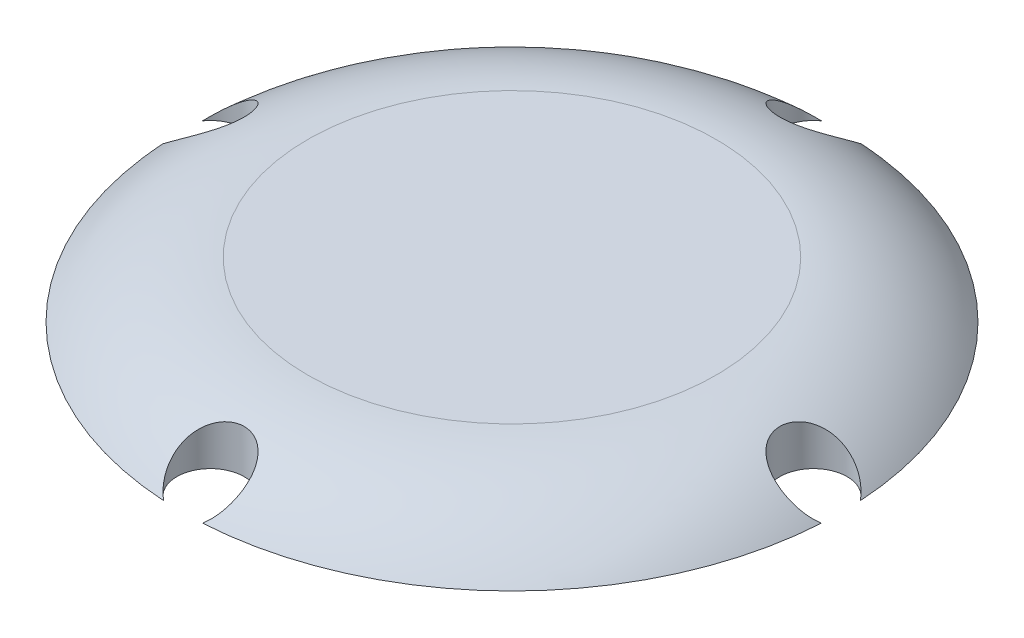
ISO-10303-21;
HEADER;
FILE_DESCRIPTION(('STEP AP214'),'2;1');
FILE_NAME('part.step','',(''),(''),'','','');
FILE_SCHEMA(('AUTOMOTIVE_DESIGN { 1 0 10303 214 1 1 1 1 }'));
ENDSEC;
DATA;
#1=APPLICATION_CONTEXT('core data for automotive mechanical design processes');
#2=APPLICATION_PROTOCOL_DEFINITION('international standard','automotive_design',2000,#1);
#3=PRODUCT_CONTEXT('',#1,'mechanical');
#4=PRODUCT('Part','Part','',(#3));
#5=PRODUCT_RELATED_PRODUCT_CATEGORY('part','',(#4));
#6=PRODUCT_DEFINITION_FORMATION('','',#4);
#7=PRODUCT_DEFINITION_CONTEXT('part definition',#1,'design');
#8=PRODUCT_DEFINITION('design','',#6,#7);
#9=PRODUCT_DEFINITION_SHAPE('','',#8);
#10=(LENGTH_UNIT() NAMED_UNIT(*) SI_UNIT(.MILLI.,.METRE.));
#11=(NAMED_UNIT(*) PLANE_ANGLE_UNIT() SI_UNIT($,.RADIAN.));
#12=(NAMED_UNIT(*) SI_UNIT($,.STERADIAN.) SOLID_ANGLE_UNIT());
#13=UNCERTAINTY_MEASURE_WITH_UNIT(LENGTH_MEASURE(1.E-05),#10,'distance_accuracy_value','');
#14=(GEOMETRIC_REPRESENTATION_CONTEXT(3) GLOBAL_UNCERTAINTY_ASSIGNED_CONTEXT((#13)) GLOBAL_UNIT_ASSIGNED_CONTEXT((#10,
#11,#12)) REPRESENTATION_CONTEXT('',''));
#15=CARTESIAN_POINT('',(0.,0.,0.));
#16=DIRECTION('',(0.,0.,1.));
#17=DIRECTION('',(1.,0.,0.));
#18=AXIS2_PLACEMENT_3D('',#15,#16,#17);
#19=CARTESIAN_POINT('',(0.,10.,0.));
#20=DIRECTION('',(0.,1.,0.));
#21=DIRECTION('',(0.,0.,1.));
#22=AXIS2_PLACEMENT_3D('',#19,#20,#21);
#23=PLANE('',#22);
#24=CARTESIAN_POINT('',(0.,10.,0.));
#25=DIRECTION('',(0.,1.,0.));
#26=DIRECTION('',(0.,0.,1.));
#27=AXIS2_PLACEMENT_3D('',#24,#25,#26);
#28=CIRCLE('',#27,36.4393202250021);
#29=CARTESIAN_POINT('',(0.,10.,36.4393202250021));
#30=VERTEX_POINT('',#29);
#31=EDGE_CURVE('E98',#30,#30,#28,.T.);
#32=ORIENTED_EDGE('',*,*,#31,.T.);
#33=EDGE_LOOP('',(#32));
#34=FACE_BOUND('',#33,.T.);
#35=ADVANCED_FACE('F46',(#34),#23,.T.);
#36=CARTESIAN_POINT('',(0.,0.,0.));
#37=DIRECTION('',(0.,1.,0.));
#38=DIRECTION('',(0.,0.,1.));
#39=AXIS2_PLACEMENT_3D('',#36,#37,#38);
#40=PLANE('',#39);
#41=CARTESIAN_POINT('',(0.,0.,0.));
#42=DIRECTION('',(0.,-1.,0.));
#43=DIRECTION('',(0.,0.,-1.));
#44=AXIS2_PLACEMENT_3D('',#41,#42,#43);
#45=CIRCLE('',#44,34.6146270857202);
#46=CARTESIAN_POINT('',(0.,0.,-34.6146270857202));
#47=VERTEX_POINT('',#46);
#48=EDGE_CURVE('E123',#47,#47,#45,.T.);
#49=ORIENTED_EDGE('',*,*,#48,.F.);
#50=EDGE_LOOP('',(#49));
#51=FACE_BOUND('',#50,.T.);
#52=CARTESIAN_POINT('',(0.,0.,0.));
#53=DIRECTION('',(0.,1.,0.));
#54=DIRECTION('',(0.,0.,1.));
#55=AXIS2_PLACEMENT_3D('',#52,#53,#54);
#56=CIRCLE('',#55,58.8);
#57=CARTESIAN_POINT('',(3.46581213584982,0.,58.6977695167286));
#58=VERTEX_POINT('',#57);
#59=CARTESIAN_POINT('',(58.6977695167286,0.,3.46581213584961));
#60=VERTEX_POINT('',#59);
#61=EDGE_CURVE('E117',#58,#60,#56,.T.);
#62=ORIENTED_EDGE('',*,*,#61,.F.);
#63=CARTESIAN_POINT('',(0.,0.,53.8));
#64=DIRECTION('',(0.,-1.,0.));
#65=DIRECTION('',(0.,0.,-1.));
#66=AXIS2_PLACEMENT_3D('',#63,#64,#65);
#67=CIRCLE('',#66,6.);
#68=CARTESIAN_POINT('',(-3.46581213584982,0.,58.6977695167286));
#69=VERTEX_POINT('',#68);
#70=EDGE_CURVE('E163',#69,#58,#67,.T.);
#71=ORIENTED_EDGE('',*,*,#70,.F.);
#72=CARTESIAN_POINT('',(-58.6977695167286,0.,3.46581213585043));
#73=VERTEX_POINT('',#72);
#74=EDGE_CURVE('E106',#73,#69,#56,.T.);
#75=ORIENTED_EDGE('',*,*,#74,.F.);
#76=CARTESIAN_POINT('',(-53.8,0.,5.63525088089282E-13));
#77=DIRECTION('',(0.,-1.,0.));
#78=DIRECTION('',(0.,0.,-1.));
#79=AXIS2_PLACEMENT_3D('',#76,#77,#78);
#80=CIRCLE('',#79,6.);
#81=CARTESIAN_POINT('',(-58.6977695167287,0.,-3.4658121358492));
#82=VERTEX_POINT('',#81);
#83=EDGE_CURVE('E67',#82,#73,#80,.T.);
#84=ORIENTED_EDGE('',*,*,#83,.F.);
#85=CARTESIAN_POINT('',(-3.46581213585023,0.,-58.6977695167286));
#86=VERTEX_POINT('',#85);
#87=EDGE_CURVE('E104',#86,#82,#56,.T.);
#88=ORIENTED_EDGE('',*,*,#87,.F.);
#89=CARTESIAN_POINT('',(-3.75683392059521E-13,0.,-53.8));
#90=DIRECTION('',(0.,-1.,0.));
#91=DIRECTION('',(0.,0.,-1.));
#92=AXIS2_PLACEMENT_3D('',#89,#90,#91);
#93=CIRCLE('',#92,6.);
#94=CARTESIAN_POINT('',(3.46581213584941,0.,-58.6977695167286));
#95=VERTEX_POINT('',#94);
#96=EDGE_CURVE('E74',#95,#86,#93,.T.);
#97=ORIENTED_EDGE('',*,*,#96,.F.);
#98=CARTESIAN_POINT('',(58.6977695167286,0.,-3.46581213585002));
#99=VERTEX_POINT('',#98);
#100=EDGE_CURVE('E113',#99,#95,#56,.T.);
#101=ORIENTED_EDGE('',*,*,#100,.F.);
#102=CARTESIAN_POINT('',(53.8,0.,-1.87841696029761E-13));
#103=DIRECTION('',(0.,-1.,0.));
#104=DIRECTION('',(0.,0.,-1.));
#105=AXIS2_PLACEMENT_3D('',#102,#103,#104);
#106=CIRCLE('',#105,6.);
#107=EDGE_CURVE('E167',#60,#99,#106,.T.);
#108=ORIENTED_EDGE('',*,*,#107,.F.);
#109=EDGE_LOOP('',(#62,#71,#75,#84,#88,#97,#101,#108));
#110=FACE_BOUND('',#109,.T.);
#111=ADVANCED_FACE('F103',(#51,#110),#40,.F.);
#112=CARTESIAN_POINT('',(0.,-20.,0.));
#113=DIRECTION('',(0.,-1.,0.));
#114=DIRECTION('',(0.,0.,-1.));
#115=AXIS2_PLACEMENT_3D('',#112,#113,#114);
#116=TOROIDAL_SURFACE('',#115,36.4393202250021,30.);
#117=CARTESIAN_POINT('',(3.46553583253374,-0.0002,58.6979650257454));
#118=CARTESIAN_POINT('',(3.5558869809211,0.0652055483690038,58.6340304452409));
#119=CARTESIAN_POINT('',(3.64371053577714,0.132121107910499,58.5681468079905));
#120=CARTESIAN_POINT('',(3.81435968798358,0.26854578930122,58.4327674310678));
#121=CARTESIAN_POINT('',(3.89718692167157,0.3380540498162,58.3632728880302));
#122=CARTESIAN_POINT('',(4.1380835569917,0.549663816380266,58.1499693700189));
#123=CARTESIAN_POINT('',(4.28886287916948,0.695066932544035,58.0011296032495));
#124=CARTESIAN_POINT('',(4.57063315979327,0.991189557479545,57.6926538642796));
#125=CARTESIAN_POINT('',(4.70171380280407,1.14188086362398,57.533071928734));
#126=CARTESIAN_POINT('',(4.94533166596503,1.44725837767899,57.2037700731015));
#127=CARTESIAN_POINT('',(5.0578618462832,1.60194607656434,57.0340463373774));
#128=CARTESIAN_POINT('',(5.25544558650792,1.90006618495907,56.7007723935405));
#129=CARTESIAN_POINT('',(5.3420356437114,2.04331136175965,56.5379631772336));
#130=CARTESIAN_POINT('',(5.49969293577057,2.33062017522033,56.2056660305868));
#131=CARTESIAN_POINT('',(5.57075480089029,2.47468407738663,56.0361758137598));
#132=CARTESIAN_POINT('',(5.76052216977926,2.90721718976167,55.5180701708327));
#133=CARTESIAN_POINT('',(5.85555880071061,3.19564627212132,55.1602441777271));
#134=CARTESIAN_POINT('',(5.95276204092302,3.64483381142573,54.5816818379375));
#135=CARTESIAN_POINT('',(5.97716913902422,3.80833907023288,54.3664825972896));
#136=CARTESIAN_POINT('',(6.00250482381479,4.13150036849085,53.9316661935034));
#137=CARTESIAN_POINT('',(6.0034294617481,4.29115575604677,53.7120482935476));
#138=CARTESIAN_POINT('',(5.98068293816353,4.60490334590427,53.2706591749769));
#139=CARTESIAN_POINT('',(5.95705195323374,4.75900421002941,53.0488920600315));
#140=CARTESIAN_POINT('',(5.88409837667664,5.06049135401063,52.6050455312248));
#141=CARTESIAN_POINT('',(5.83478590316606,5.2078802534279,52.3829662746832));
#142=CARTESIAN_POINT('',(5.72625873629117,5.45597169570146,52.0005070675757));
#143=CARTESIAN_POINT('',(5.67326262915145,5.55857964970645,51.8395786316137));
#144=CARTESIAN_POINT('',(5.55261204567847,5.75884253819105,51.5201692778292));
#145=CARTESIAN_POINT('',(5.48496090077979,5.85649859213784,51.3616878125097));
#146=CARTESIAN_POINT('',(5.33473729531485,6.04628241042703,51.0485018874182));
#147=CARTESIAN_POINT('',(5.25216422904856,6.13840995015762,50.8937975812554));
#148=CARTESIAN_POINT('',(5.0720350733488,6.31650283343753,50.5897566553267));
#149=CARTESIAN_POINT('',(4.97448643423619,6.40247121013745,50.4404174117925));
#150=CARTESIAN_POINT('',(4.76364937393307,6.56836880687971,50.1475420252663));
#151=CARTESIAN_POINT('',(4.65024498272296,6.64824613989962,50.0040597379913));
#152=CARTESIAN_POINT('',(4.40867169719676,6.80063919894988,49.7259956243438));
#153=CARTESIAN_POINT('',(4.28051002791773,6.87315849497153,49.591409492866));
#154=CARTESIAN_POINT('',(4.01003106731339,7.01038088917507,49.3329390416587));
#155=CARTESIAN_POINT('',(3.86771681580253,7.07508565924533,49.2090524344278));
#156=CARTESIAN_POINT('',(3.56985398224137,7.19627935034101,48.9738067771556));
#157=CARTESIAN_POINT('',(3.41430748688584,7.2527695629907,48.8624457582656));
#158=CARTESIAN_POINT('',(3.11155709244978,7.35064392271163,48.6671187080399));
#159=CARTESIAN_POINT('',(2.96576157091769,7.39303430948953,48.5814686724121));
#160=CARTESIAN_POINT('',(2.66604939034357,7.47112407566942,48.4221779313096));
#161=CARTESIAN_POINT('',(2.51213367500718,7.50682423040541,48.3485358343582));
#162=CARTESIAN_POINT('',(2.19743279677077,7.57140136555867,48.2142551139282));
#163=CARTESIAN_POINT('',(2.03665062092316,7.60028127792935,48.1536109038293));
#164=CARTESIAN_POINT('',(1.70948587321766,7.65115598103324,48.0461057063587));
#165=CARTESIAN_POINT('',(1.54310364414782,7.673151192344,47.9992438770496));
#166=CARTESIAN_POINT('',(1.22120062941942,7.7085561798832,47.9234765590647));
#167=CARTESIAN_POINT('',(1.06603219314069,7.72255611051626,47.8933435829854));
#168=CARTESIAN_POINT('',(0.753399546864709,7.74478148236828,47.8453888564223));
#169=CARTESIAN_POINT('',(0.59593547189509,7.75300726183058,47.8275663848039));
#170=CARTESIAN_POINT('',(0.279933096603168,7.76367284496199,47.8044407069692));
#171=CARTESIAN_POINT('',(0.121395051034823,7.7661139757039,47.7991346293325));
#172=CARTESIAN_POINT('',(-0.19558772465995,7.76521132082239,47.8010947292263));
#173=CARTESIAN_POINT('',(-0.354032455237427,7.76186756339428,47.8083608454804));
#174=CARTESIAN_POINT('',(-0.66468761482286,7.74959439102201,47.834957601499));
#175=CARTESIAN_POINT('',(-0.816938148588741,7.74084277112035,47.8539041769245));
#176=CARTESIAN_POINT('',(-1.11919675992283,7.71792179092903,47.9033182089293));
#177=CARTESIAN_POINT('',(-1.26920407286724,7.70375062518648,47.9337895047855));
#178=CARTESIAN_POINT('',(-1.56581819691129,7.67001900895754,48.0059082378308));
#179=CARTESIAN_POINT('',(-1.71242642225618,7.65046084508575,48.0475509329107));
#180=CARTESIAN_POINT('',(-2.0013741213263,7.6059795368125,48.1415908379275));
#181=CARTESIAN_POINT('',(-2.14371198430704,7.58105439631309,48.1939920488576));
#182=CARTESIAN_POINT('',(-2.42419449021421,7.5256891298284,48.3094214608353));
#183=CARTESIAN_POINT('',(-2.56229945788343,7.49520886525519,48.3725267579095));
#184=CARTESIAN_POINT('',(-2.8323742005879,7.42892811606181,48.508448280721));
#185=CARTESIAN_POINT('',(-2.96434174570643,7.3931257172667,48.581267999406));
#186=CARTESIAN_POINT('',(-3.22129184278893,7.31632630951357,48.7358366343211));
#187=CARTESIAN_POINT('',(-3.34627644928409,7.27533084019122,48.8175829030306));
#188=CARTESIAN_POINT('',(-3.58869553011209,7.18825922411399,48.9892478626757));
#189=CARTESIAN_POINT('',(-3.70612714397142,7.14218117020811,49.0791696190804));
#190=CARTESIAN_POINT('',(-3.93808221361809,7.04288203206813,49.2706353395151));
#191=CARTESIAN_POINT('',(-4.05222266412381,6.98942971209695,49.3725238322217));
#192=CARTESIAN_POINT('',(-4.27114607971376,6.87738122744485,49.5833143936305));
#193=CARTESIAN_POINT('',(-4.37592561693747,6.81878319391097,49.692219006635));
#194=CARTESIAN_POINT('',(-4.67561114538557,6.63565986502228,50.0279327637283));
#195=CARTESIAN_POINT('',(-4.85601849409595,6.50373906748901,50.2638709790288));
#196=CARTESIAN_POINT('',(-5.19169347802565,6.20933204683089,50.7753149337403));
#197=CARTESIAN_POINT('',(-5.34293335938855,6.04513165232125,51.0524492366829));
#198=CARTESIAN_POINT('',(-5.59762816789149,5.69941924709727,51.6176305241568));
#199=CARTESIAN_POINT('',(-5.70105715425565,5.51789790283017,51.9056833412637));
#200=CARTESIAN_POINT('',(-5.87363170467522,5.11356952487324,52.5275375067845));
#201=CARTESIAN_POINT('',(-5.93561651372865,4.88859522274652,52.8619072134707));
#202=CARTESIAN_POINT('',(-6.00310407350312,4.42537235802746,53.5269153208768));
#203=CARTESIAN_POINT('',(-6.00858982969165,4.18711982309773,53.8575525690272));
#204=CARTESIAN_POINT('',(-5.96338176673379,3.66084525341512,54.5640047638014));
#205=CARTESIAN_POINT('',(-5.90303095583435,3.37122006789491,54.9380045645933));
#206=CARTESIAN_POINT('',(-5.71498466850118,2.78658983909732,55.6656122331743));
#207=CARTESIAN_POINT('',(-5.58714533765546,2.49157460847658,56.0191747451266));
#208=CARTESIAN_POINT('',(-5.33677146074572,2.03287202204755,56.55021574528));
#209=CARTESIAN_POINT('',(-5.23619779037311,1.86797374783781,56.7372908850102));
#210=CARTESIAN_POINT('',(-5.01450699212456,1.54077112963147,57.1015432581709));
#211=CARTESIAN_POINT('',(-4.89338183601541,1.37846782655062,57.2787165874635));
#212=CARTESIAN_POINT('',(-4.63100966688985,1.05918237003518,57.6210071744232));
#213=CARTESIAN_POINT('',(-4.48984093109845,0.902182327243077,57.7861677199209));
#214=CARTESIAN_POINT('',(-4.18672608660293,0.595437030883278,58.1034151945251));
#215=CARTESIAN_POINT('',(-4.02480271435417,0.445684081899274,58.2555161302476));
#216=CARTESIAN_POINT('',(-3.79054159370957,0.249482780192598,58.4516954861795));
#217=CARTESIAN_POINT('',(-3.72746313594492,0.198461428874359,58.5024085465046));
#218=CARTESIAN_POINT('',(-3.59856809592607,0.0979472814461536,58.6017624544569));
#219=CARTESIAN_POINT('',(-3.53275247826005,0.0484539573874458,58.6504040200609));
#220=CARTESIAN_POINT('',(-3.46553583253374,-0.000199999999997614,58.6979650257454));
#221=B_SPLINE_CURVE_WITH_KNOTS('',3,(#117,#118,#119,#120,#121,#122,#123,#124,#125,#126,#127,
#128,#129,#130,#131,#132,#133,#134,#135,#136,#137,#138,#139,#140,#141,#142,#143,#144,#145,#146,
#147,#148,#149,#150,#151,#152,#153,#154,#155,#156,#157,#158,#159,#160,#161,#162,#163,#164,#165,
#166,#167,#168,#169,#170,#171,#172,#173,#174,#175,#176,#177,#178,#179,#180,#181,#182,#183,#184,
#185,#186,#187,#188,#189,#190,#191,#192,#193,#194,#195,#196,#197,#198,#199,#200,#201,#202,#203,
#204,#205,#206,#207,#208,#209,#210,#211,#212,#213,#214,#215,#216,#217,#218,#219,#220),
.UNSPECIFIED.,.F.,.F.,(4,2,2,2,2,2,2,2,2,2,2,2,2,2,2,2,2,2,2,2,2,2,2,2,2,2,2,2,2,2,2,2,2,2,2,2,
2,2,2,2,2,2,2,2,2,2,2,2,2,2,2,4),(0.,0.38557907268935,0.771031171565329,1.54067398136549,
2.30669905225075,3.07301416090675,3.77287518761874,4.47297784854646,5.87503678249483,
6.6882802604822,7.50166049070263,8.31371200422432,9.12544382353945,9.71911873254296,
10.3126588266395,10.9062230187076,11.499492864911,12.097354119886,12.6949239018031,
13.2923656085833,13.8897132741989,14.4119873295636,14.9342008208724,15.4561894075391,
15.9781461003657,16.4536179325222,16.929061909745,17.4043968034416,17.8797293803817,
18.3402096306782,18.800843417941,19.2612819808873,19.7218920878782,20.1859727421436,
20.6502207147248,21.1143313683302,21.5786167676048,22.0642844996778,22.5501293549888,
23.521190095558,24.5846862547626,25.6487587601696,26.8673710638514,28.0863499071609,
29.5114614631273,30.9396230384491,31.7454827078259,32.5516579061037,33.3547671437427,
34.1570039863167,34.443972474328,34.7308406762779),.UNSPECIFIED.);
#222=EDGE_CURVE('E12',#58,#69,#221,.T.);
#223=ORIENTED_EDGE('',*,*,#222,.F.);
#224=ORIENTED_EDGE('',*,*,#61,.T.);
#225=CARTESIAN_POINT('',(58.6979650257453,-0.000199999999997381,-3.46553583253393));
#226=CARTESIAN_POINT('',(58.6340304452409,0.0652055483690092,-3.5558869809213));
#227=CARTESIAN_POINT('',(58.5681468079905,0.132121107910503,-3.64371053577734));
#228=CARTESIAN_POINT('',(58.4327674310678,0.268545789301219,-3.81435968798378));
#229=CARTESIAN_POINT('',(58.3632728880302,0.338054049816196,-3.89718692167177));
#230=CARTESIAN_POINT('',(58.1499693700189,0.549663816380258,-4.1380835569919));
#231=CARTESIAN_POINT('',(58.0011296032495,0.695066932544033,-4.28886287916968));
#232=CARTESIAN_POINT('',(57.6926538642796,0.991189557479547,-4.57063315979347));
#233=CARTESIAN_POINT('',(57.533071928734,1.14188086362398,-4.70171380280427));
#234=CARTESIAN_POINT('',(57.2037700731015,1.44725837767899,-4.94533166596523));
#235=CARTESIAN_POINT('',(57.0340463373774,1.60194607656434,-5.0578618462834));
#236=CARTESIAN_POINT('',(56.7007723935405,1.90006618495908,-5.25544558650811));
#237=CARTESIAN_POINT('',(56.5379631772336,2.04331136175965,-5.3420356437116));
#238=CARTESIAN_POINT('',(56.2056660305868,2.33062017522033,-5.49969293577077));
#239=CARTESIAN_POINT('',(56.0361758137598,2.47468407738663,-5.57075480089049));
#240=CARTESIAN_POINT('',(55.5180701708327,2.90721718976166,-5.76052216977946));
#241=CARTESIAN_POINT('',(55.1602441777271,3.19564627212132,-5.85555880071081));
#242=CARTESIAN_POINT('',(54.5816818379375,3.64483381142572,-5.95276204092321));
#243=CARTESIAN_POINT('',(54.3664825972896,3.80833907023287,-5.9771691390244));
#244=CARTESIAN_POINT('',(53.9316661935034,4.13150036849084,-6.00250482381498));
#245=CARTESIAN_POINT('',(53.7120482935476,4.29115575604675,-6.00342946174828));
#246=CARTESIAN_POINT('',(53.2706591749769,4.60490334590425,-5.98068293816371));
#247=CARTESIAN_POINT('',(53.0488920600315,4.75900421002941,-5.95705195323393));
#248=CARTESIAN_POINT('',(52.6050455312248,5.06049135401063,-5.88409837667683));
#249=CARTESIAN_POINT('',(52.3829662746832,5.20788025342789,-5.83478590316625));
#250=CARTESIAN_POINT('',(52.0005070675757,5.45597169570146,-5.72625873629136));
#251=CARTESIAN_POINT('',(51.8395786316137,5.55857964970645,-5.67326262915164));
#252=CARTESIAN_POINT('',(51.5201692778291,5.75884253819105,-5.55261204567864));
#253=CARTESIAN_POINT('',(51.3616878125096,5.85649859213784,-5.48496090077996));
#254=CARTESIAN_POINT('',(51.0485018874181,6.04628241042703,-5.33473729531503));
#255=CARTESIAN_POINT('',(50.8937975812554,6.13840995015762,-5.25216422904874));
#256=CARTESIAN_POINT('',(50.5897566553267,6.31650283343753,-5.07203507334898));
#257=CARTESIAN_POINT('',(50.4404174117925,6.40247121013746,-4.97448643423636));
#258=CARTESIAN_POINT('',(50.1475420252662,6.56836880687972,-4.76364937393325));
#259=CARTESIAN_POINT('',(50.0040597379912,6.64824613989962,-4.65024498272313));
#260=CARTESIAN_POINT('',(49.7259956243437,6.80063919894989,-4.40867169719693));
#261=CARTESIAN_POINT('',(49.591409492866,6.87315849497153,-4.2805100279179));
#262=CARTESIAN_POINT('',(49.3329390416587,7.01038088917508,-4.01003106731356));
#263=CARTESIAN_POINT('',(49.2090524344278,7.07508565924533,-3.8677168158027));
#264=CARTESIAN_POINT('',(48.9738067771556,7.19627935034101,-3.56985398224153));
#265=CARTESIAN_POINT('',(48.8624457582656,7.2527695629907,-3.414307486886));
#266=CARTESIAN_POINT('',(48.6671187080399,7.35064392271163,-3.11155709244994));
#267=CARTESIAN_POINT('',(48.5814686724121,7.39303430948953,-2.96576157091785));
#268=CARTESIAN_POINT('',(48.4221779313096,7.47112407566942,-2.66604939034373));
#269=CARTESIAN_POINT('',(48.3485358343582,7.50682423040541,-2.51213367500734));
#270=CARTESIAN_POINT('',(48.2142551139282,7.57140136555867,-2.19743279677093));
#271=CARTESIAN_POINT('',(48.1536109038293,7.60028127792935,-2.03665062092332));
#272=CARTESIAN_POINT('',(48.0461057063587,7.65115598103324,-1.70948587321781));
#273=CARTESIAN_POINT('',(47.9992438770496,7.673151192344,-1.54310364414798));
#274=CARTESIAN_POINT('',(47.9234765590647,7.70855617988321,-1.22120062941957));
#275=CARTESIAN_POINT('',(47.8933435829854,7.72255611051625,-1.06603219314084));
#276=CARTESIAN_POINT('',(47.8453888564223,7.74478148236827,-0.753399546864861));
#277=CARTESIAN_POINT('',(47.8275663848039,7.75300726183058,-0.595935471895245));
#278=CARTESIAN_POINT('',(47.8044407069692,7.76367284496199,-0.279933096603325));
#279=CARTESIAN_POINT('',(47.7991346293325,7.7661139757039,-0.12139505103498));
#280=CARTESIAN_POINT('',(47.8010947292263,7.76521132082239,0.195587724659793));
#281=CARTESIAN_POINT('',(47.8083608454804,7.76186756339428,0.35403245523727));
#282=CARTESIAN_POINT('',(47.834957601499,7.74959439102201,0.664687614822703));
#283=CARTESIAN_POINT('',(47.8539041769245,7.74084277112035,0.816938148588585));
#284=CARTESIAN_POINT('',(47.9033182089293,7.71792179092902,1.11919675992268));
#285=CARTESIAN_POINT('',(47.9337895047855,7.70375062518647,1.26920407286708));
#286=CARTESIAN_POINT('',(48.0059082378308,7.67001900895753,1.56581819691113));
#287=CARTESIAN_POINT('',(48.0475509329107,7.65046084508575,1.71242642225602));
#288=CARTESIAN_POINT('',(48.1415908379275,7.60597953681249,2.00137412132614));
#289=CARTESIAN_POINT('',(48.1939920488576,7.58105439631309,2.14371198430688));
#290=CARTESIAN_POINT('',(48.3094214608353,7.52568912982839,2.42419449021404));
#291=CARTESIAN_POINT('',(48.3725267579095,7.49520886525519,2.56229945788327));
#292=CARTESIAN_POINT('',(48.508448280721,7.42892811606181,2.83237420058773));
#293=CARTESIAN_POINT('',(48.5812679994061,7.3931257172667,2.96434174570626));
#294=CARTESIAN_POINT('',(48.7358366343211,7.31632630951357,3.22129184278876));
#295=CARTESIAN_POINT('',(48.8175829030307,7.27533084019122,3.34627644928393));
#296=CARTESIAN_POINT('',(48.9892478626757,7.18825922411399,3.58869553011192));
#297=CARTESIAN_POINT('',(49.0791696190805,7.14218117020811,3.70612714397125));
#298=CARTESIAN_POINT('',(49.2706353395151,7.04288203206813,3.93808221361792));
#299=CARTESIAN_POINT('',(49.3725238322217,6.98942971209695,4.05222266412364));
#300=CARTESIAN_POINT('',(49.5833143936305,6.87738122744485,4.27114607971359));
#301=CARTESIAN_POINT('',(49.692219006635,6.81878319391097,4.37592561693731));
#302=CARTESIAN_POINT('',(50.0279327637284,6.63565986502228,4.6756111453854));
#303=CARTESIAN_POINT('',(50.2638709790288,6.503739067489,4.85601849409578));
#304=CARTESIAN_POINT('',(50.7753149337403,6.20933204683089,5.19169347802548));
#305=CARTESIAN_POINT('',(51.052449236683,6.04513165232124,5.34293335938837));
#306=CARTESIAN_POINT('',(51.6176305241568,5.69941924709727,5.59762816789131));
#307=CARTESIAN_POINT('',(51.9056833412637,5.51789790283018,5.70105715425547));
#308=CARTESIAN_POINT('',(52.5275375067846,5.11356952487324,5.87363170467504));
#309=CARTESIAN_POINT('',(52.8619072134707,4.88859522274652,5.93561651372846));
#310=CARTESIAN_POINT('',(53.5269153208768,4.42537235802746,6.00310407350294));
#311=CARTESIAN_POINT('',(53.8575525690272,4.18711982309773,6.00858982969146));
#312=CARTESIAN_POINT('',(54.5640047638014,3.66084525341512,5.9633817667336));
#313=CARTESIAN_POINT('',(54.9380045645934,3.37122006789491,5.90303095583416));
#314=CARTESIAN_POINT('',(55.6656122331744,2.78658983909732,5.71498466850098));
#315=CARTESIAN_POINT('',(56.0191747451266,2.49157460847658,5.58714533765526));
#316=CARTESIAN_POINT('',(56.55021574528,2.03287202204754,5.33677146074552));
#317=CARTESIAN_POINT('',(56.7372908850102,1.8679737478378,5.2361977903729));
#318=CARTESIAN_POINT('',(57.1015432581709,1.54077112963146,5.01450699212436));
#319=CARTESIAN_POINT('',(57.2787165874635,1.37846782655061,4.8933818360152));
#320=CARTESIAN_POINT('',(57.6210071744232,1.05918237003517,4.63100966688965));
#321=CARTESIAN_POINT('',(57.7861677199209,0.902182327243071,4.48984093109825));
#322=CARTESIAN_POINT('',(58.1034151945251,0.595437030883278,4.18672608660273));
#323=CARTESIAN_POINT('',(58.2555161302476,0.445684081899281,4.02480271435395));
#324=CARTESIAN_POINT('',(58.4516954861795,0.249482780192597,3.79054159370937));
#325=CARTESIAN_POINT('',(58.5024085465046,0.198461428874355,3.72746313594472));
#326=CARTESIAN_POINT('',(58.6017624544569,0.0979472814461461,3.59856809592587));
#327=CARTESIAN_POINT('',(58.6504040200609,0.0484539573874369,3.53275247825985));
#328=CARTESIAN_POINT('',(58.6979650257454,-0.00020000000000205,3.46553583253353));
#329=B_SPLINE_CURVE_WITH_KNOTS('',3,(#225,#226,#227,#228,#229,#230,#231,#232,#233,#234,#235,
#236,#237,#238,#239,#240,#241,#242,#243,#244,#245,#246,#247,#248,#249,#250,#251,#252,#253,#254,
#255,#256,#257,#258,#259,#260,#261,#262,#263,#264,#265,#266,#267,#268,#269,#270,#271,#272,#273,
#274,#275,#276,#277,#278,#279,#280,#281,#282,#283,#284,#285,#286,#287,#288,#289,#290,#291,#292,
#293,#294,#295,#296,#297,#298,#299,#300,#301,#302,#303,#304,#305,#306,#307,#308,#309,#310,#311,
#312,#313,#314,#315,#316,#317,#318,#319,#320,#321,#322,#323,#324,#325,#326,#327,#328),
.UNSPECIFIED.,.F.,.F.,(4,2,2,2,2,2,2,2,2,2,2,2,2,2,2,2,2,2,2,2,2,2,2,2,2,2,2,2,2,2,2,2,2,2,2,2,
2,2,2,2,2,2,2,2,2,2,2,2,2,2,2,4),(0.,0.38557907268935,0.771031171565329,1.54067398136549,
2.30669905225075,3.07301416090675,3.77287518761875,4.47297784854647,5.87503678249482,
6.68828026048218,7.50166049070261,8.31371200422432,9.12544382353945,9.71911873254296,
10.3126588266395,10.9062230187076,11.499492864911,12.097354119886,12.6949239018031,
13.2923656085833,13.8897132741989,14.4119873295636,14.9342008208725,15.4561894075391,
15.9781461003657,16.4536179325222,16.929061909745,17.4043968034417,17.8797293803817,
18.3402096306782,18.800843417941,19.2612819808873,19.7218920878782,20.1859727421436,
20.6502207147248,21.1143313683302,21.5786167676048,22.0642844996778,22.5501293549888,
23.521190095558,24.5846862547626,25.6487587601696,26.8673710638514,28.0863499071609,
29.5114614631274,30.9396230384491,31.7454827078259,32.5516579061037,33.3547671437427,
34.1570039863167,34.443972474328,34.7308406762779),.UNSPECIFIED.);
#330=EDGE_CURVE('E61',#99,#60,#329,.T.);
#331=ORIENTED_EDGE('',*,*,#330,.F.);
#332=ORIENTED_EDGE('',*,*,#100,.T.);
#333=CARTESIAN_POINT('',(-3.46553583253414,-0.0002,-58.6979650257453));
#334=CARTESIAN_POINT('',(-3.55588698092151,0.0652055483690095,-58.6340304452409));
#335=CARTESIAN_POINT('',(-3.64371053577755,0.132121107910507,-58.5681468079905));
#336=CARTESIAN_POINT('',(-3.81435968798399,0.268545789301226,-58.4327674310678));
#337=CARTESIAN_POINT('',(-3.89718692167197,0.338054049816203,-58.3632728880302));
#338=CARTESIAN_POINT('',(-4.1380835569921,0.549663816380263,-58.1499693700189));
#339=CARTESIAN_POINT('',(-4.28886287916988,0.69506693254403,-58.0011296032494));
#340=CARTESIAN_POINT('',(-4.57063315979367,0.991189557479539,-57.6926538642796));
#341=CARTESIAN_POINT('',(-4.70171380280447,1.14188086362398,-57.533071928734));
#342=CARTESIAN_POINT('',(-4.94533166596543,1.44725837767898,-57.2037700731015));
#343=CARTESIAN_POINT('',(-5.0578618462836,1.60194607656434,-57.0340463373773));
#344=CARTESIAN_POINT('',(-5.25544558650831,1.90006618495907,-56.7007723935405));
#345=CARTESIAN_POINT('',(-5.3420356437118,2.04331136175965,-56.5379631772336));
#346=CARTESIAN_POINT('',(-5.49969293577096,2.33062017522033,-56.2056660305868));
#347=CARTESIAN_POINT('',(-5.57075480089068,2.47468407738663,-56.0361758137598));
#348=CARTESIAN_POINT('',(-5.76052216977965,2.90721718976167,-55.5180701708327));
#349=CARTESIAN_POINT('',(-5.855558800711,3.19564627212132,-55.1602441777271));
#350=CARTESIAN_POINT('',(-5.9527620409234,3.64483381142572,-54.5816818379374));
#351=CARTESIAN_POINT('',(-5.97716913902459,3.80833907023288,-54.3664825972895));
#352=CARTESIAN_POINT('',(-6.00250482381517,4.13150036849084,-53.9316661935034));
#353=CARTESIAN_POINT('',(-6.00342946174847,4.29115575604676,-53.7120482935475));
#354=CARTESIAN_POINT('',(-5.9806829381639,4.60490334590426,-53.2706591749768));
#355=CARTESIAN_POINT('',(-5.95705195323411,4.75900421002941,-53.0488920600315));
#356=CARTESIAN_POINT('',(-5.88409837667701,5.06049135401063,-52.6050455312248));
#357=CARTESIAN_POINT('',(-5.83478590316643,5.20788025342789,-52.3829662746832));
#358=CARTESIAN_POINT('',(-5.72625873629154,5.45597169570146,-52.0005070675756));
#359=CARTESIAN_POINT('',(-5.67326262915182,5.55857964970644,-51.8395786316137));
#360=CARTESIAN_POINT('',(-5.55261204567883,5.75884253819104,-51.5201692778291));
#361=CARTESIAN_POINT('',(-5.48496090078015,5.85649859213784,-51.3616878125096));
#362=CARTESIAN_POINT('',(-5.3347372953152,6.04628241042702,-51.0485018874181));
#363=CARTESIAN_POINT('',(-5.25216422904891,6.13840995015761,-50.8937975812554));
#364=CARTESIAN_POINT('',(-5.07203507334916,6.31650283343753,-50.5897566553267));
#365=CARTESIAN_POINT('',(-4.97448643423654,6.40247121013746,-50.4404174117925));
#366=CARTESIAN_POINT('',(-4.76364937393342,6.56836880687973,-50.1475420252662));
#367=CARTESIAN_POINT('',(-4.65024498272331,6.64824613989963,-50.0040597379912));
#368=CARTESIAN_POINT('',(-4.40867169719711,6.80063919894988,-49.7259956243437));
#369=CARTESIAN_POINT('',(-4.28051002791807,6.87315849497153,-49.591409492866));
#370=CARTESIAN_POINT('',(-4.01003106731373,7.01038088917507,-49.3329390416587));
#371=CARTESIAN_POINT('',(-3.86771681580287,7.07508565924533,-49.2090524344278));
#372=CARTESIAN_POINT('',(-3.5698539822417,7.19627935034101,-48.9738067771555));
#373=CARTESIAN_POINT('',(-3.41430748688617,7.2527695629907,-48.8624457582656));
#374=CARTESIAN_POINT('',(-3.1115570924501,7.35064392271163,-48.6671187080399));
#375=CARTESIAN_POINT('',(-2.96576157091801,7.39303430948953,-48.5814686724121));
#376=CARTESIAN_POINT('',(-2.6660493903439,7.47112407566942,-48.4221779313096));
#377=CARTESIAN_POINT('',(-2.51213367500751,7.50682423040541,-48.3485358343582));
#378=CARTESIAN_POINT('',(-2.1974327967711,7.57140136555867,-48.2142551139282));
#379=CARTESIAN_POINT('',(-2.03665062092349,7.60028127792935,-48.1536109038293));
#380=CARTESIAN_POINT('',(-1.70948587321798,7.65115598103323,-48.0461057063587));
#381=CARTESIAN_POINT('',(-1.54310364414815,7.673151192344,-47.9992438770495));
#382=CARTESIAN_POINT('',(-1.22120062941975,7.70855617988321,-47.9234765590647));
#383=CARTESIAN_POINT('',(-1.06603219314102,7.72255611051626,-47.8933435829854));
#384=CARTESIAN_POINT('',(-0.753399546865038,7.74478148236828,-47.8453888564223));
#385=CARTESIAN_POINT('',(-0.595935471895419,7.75300726183058,-47.8275663848039));
#386=CARTESIAN_POINT('',(-0.279933096603497,7.76367284496199,-47.8044407069692));
#387=CARTESIAN_POINT('',(-0.121395051035151,7.7661139757039,-47.7991346293325));
#388=CARTESIAN_POINT('',(0.195587724659624,7.76521132082239,-47.8010947292263));
#389=CARTESIAN_POINT('',(0.354032455237101,7.76186756339428,-47.8083608454804));
#390=CARTESIAN_POINT('',(0.664687614822532,7.74959439102201,-47.834957601499));
#391=CARTESIAN_POINT('',(0.816938148588413,7.74084277112035,-47.8539041769245));
#392=CARTESIAN_POINT('',(1.1191967599225,7.71792179092903,-47.9033182089293));
#393=CARTESIAN_POINT('',(1.26920407286691,7.70375062518648,-47.9337895047855));
#394=CARTESIAN_POINT('',(1.56581819691096,7.67001900895754,-48.0059082378308));
#395=CARTESIAN_POINT('',(1.71242642225585,7.65046084508575,-48.0475509329107));
#396=CARTESIAN_POINT('',(2.00137412132597,7.60597953681249,-48.1415908379275));
#397=CARTESIAN_POINT('',(2.14371198430671,7.5810543963131,-48.1939920488576));
#398=CARTESIAN_POINT('',(2.42419449021387,7.5256891298284,-48.3094214608353));
#399=CARTESIAN_POINT('',(2.5622994578831,7.49520886525519,-48.3725267579095));
#400=CARTESIAN_POINT('',(2.83237420058756,7.4289281160618,-48.508448280721));
#401=CARTESIAN_POINT('',(2.96434174570609,7.3931257172667,-48.5812679994061));
#402=CARTESIAN_POINT('',(3.22129184278859,7.31632630951357,-48.7358366343211));
#403=CARTESIAN_POINT('',(3.34627644928375,7.27533084019122,-48.8175829030307));
#404=CARTESIAN_POINT('',(3.58869553011175,7.18825922411399,-48.9892478626758));
#405=CARTESIAN_POINT('',(3.70612714397108,7.14218117020811,-49.0791696190805));
#406=CARTESIAN_POINT('',(3.93808221361775,7.04288203206813,-49.2706353395151));
#407=CARTESIAN_POINT('',(4.05222266412347,6.98942971209696,-49.3725238322217));
#408=CARTESIAN_POINT('',(4.27114607971341,6.87738122744485,-49.5833143936305));
#409=CARTESIAN_POINT('',(4.37592561693713,6.81878319391097,-49.692219006635));
#410=CARTESIAN_POINT('',(4.67561114538522,6.63565986502228,-50.0279327637284));
#411=CARTESIAN_POINT('',(4.8560184940956,6.503739067489,-50.2638709790288));
#412=CARTESIAN_POINT('',(5.1916934780253,6.20933204683089,-50.7753149337403));
#413=CARTESIAN_POINT('',(5.3429333593882,6.04513165232124,-51.052449236683));
#414=CARTESIAN_POINT('',(5.59762816789113,5.69941924709726,-51.6176305241569));
#415=CARTESIAN_POINT('',(5.70105715425529,5.51789790283016,-51.9056833412637));
#416=CARTESIAN_POINT('',(5.87363170467485,5.11356952487323,-52.5275375067846));
#417=CARTESIAN_POINT('',(5.93561651372828,4.88859522274652,-52.8619072134707));
#418=CARTESIAN_POINT('',(6.00310407350275,4.42537235802745,-53.5269153208769));
#419=CARTESIAN_POINT('',(6.00858982969128,4.18711982309772,-53.8575525690273));
#420=CARTESIAN_POINT('',(5.96338176673341,3.66084525341512,-54.5640047638014));
#421=CARTESIAN_POINT('',(5.90303095583397,3.3712200678949,-54.9380045645934));
#422=CARTESIAN_POINT('',(5.71498466850078,2.78658983909732,-55.6656122331744));
#423=CARTESIAN_POINT('',(5.58714533765507,2.49157460847657,-56.0191747451266));
#424=CARTESIAN_POINT('',(5.33677146074532,2.03287202204754,-56.55021574528));
#425=CARTESIAN_POINT('',(5.23619779037271,1.8679737478378,-56.7372908850102));
#426=CARTESIAN_POINT('',(5.01450699212416,1.54077112963146,-57.101543258171));
#427=CARTESIAN_POINT('',(4.893381836015,1.37846782655061,-57.2787165874635));
#428=CARTESIAN_POINT('',(4.63100966688945,1.05918237003517,-57.6210071744232));
#429=CARTESIAN_POINT('',(4.48984093109804,0.90218232724307,-57.7861677199209));
#430=CARTESIAN_POINT('',(4.18672608660252,0.595437030883271,-58.1034151945252));
#431=CARTESIAN_POINT('',(4.02480271435376,0.445684081899268,-58.2555161302476));
#432=CARTESIAN_POINT('',(3.79054159370916,0.249482780192595,-58.4516954861795));
#433=CARTESIAN_POINT('',(3.72746313594451,0.198461428874357,-58.5024085465047));
#434=CARTESIAN_POINT('',(3.59856809592566,0.0979472814461513,-58.6017624544569));
#435=CARTESIAN_POINT('',(3.53275247825963,0.0484539573874421,-58.6504040200609));
#436=CARTESIAN_POINT('',(3.46553583253332,-0.000200000000004982,-58.6979650257454));
#437=B_SPLINE_CURVE_WITH_KNOTS('',3,(#333,#334,#335,#336,#337,#338,#339,#340,#341,#342,#343,
#344,#345,#346,#347,#348,#349,#350,#351,#352,#353,#354,#355,#356,#357,#358,#359,#360,#361,#362,
#363,#364,#365,#366,#367,#368,#369,#370,#371,#372,#373,#374,#375,#376,#377,#378,#379,#380,#381,
#382,#383,#384,#385,#386,#387,#388,#389,#390,#391,#392,#393,#394,#395,#396,#397,#398,#399,#400,
#401,#402,#403,#404,#405,#406,#407,#408,#409,#410,#411,#412,#413,#414,#415,#416,#417,#418,#419,
#420,#421,#422,#423,#424,#425,#426,#427,#428,#429,#430,#431,#432,#433,#434,#435,#436),
.UNSPECIFIED.,.F.,.F.,(4,2,2,2,2,2,2,2,2,2,2,2,2,2,2,2,2,2,2,2,2,2,2,2,2,2,2,2,2,2,2,2,2,2,2,2,
2,2,2,2,2,2,2,2,2,2,2,2,2,2,2,4),(0.,0.385579072689353,0.771031171565329,1.54067398136549,
2.30669905225074,3.07301416090675,3.77287518761874,4.47297784854646,5.87503678249483,
6.68828026048219,7.50166049070262,8.31371200422431,9.12544382353945,9.71911873254296,
10.3126588266395,10.9062230187076,11.499492864911,12.097354119886,12.6949239018031,
13.2923656085833,13.8897132741989,14.4119873295636,14.9342008208725,15.4561894075391,
15.9781461003657,16.4536179325222,16.929061909745,17.4043968034416,17.8797293803817,
18.3402096306782,18.800843417941,19.2612819808873,19.7218920878782,20.1859727421436,
20.6502207147248,21.1143313683302,21.5786167676048,22.0642844996778,22.5501293549888,
23.521190095558,24.5846862547626,25.6487587601696,26.8673710638514,28.0863499071609,
29.5114614631273,30.9396230384491,31.7454827078259,32.5516579061037,33.3547671437428,
34.1570039863167,34.443972474328,34.7308406762779),.UNSPECIFIED.);
#438=EDGE_CURVE('E97',#86,#95,#437,.T.);
#439=ORIENTED_EDGE('',*,*,#438,.F.);
#440=ORIENTED_EDGE('',*,*,#87,.T.);
#441=CARTESIAN_POINT('',(-58.6979650257453,-0.000200000000004502,3.46553583253434));
#442=CARTESIAN_POINT('',(-58.6340304452409,0.0652055483690048,3.5558869809217));
#443=CARTESIAN_POINT('',(-58.5681468079904,0.132121107910501,3.64371053577774));
#444=CARTESIAN_POINT('',(-58.4327674310678,0.26854578930122,3.81435968798418));
#445=CARTESIAN_POINT('',(-58.3632728880302,0.338054049816197,3.89718692167217));
#446=CARTESIAN_POINT('',(-58.1499693700189,0.549663816380258,4.1380835569923));
#447=CARTESIAN_POINT('',(-58.0011296032494,0.695066932544027,4.28886287917008));
#448=CARTESIAN_POINT('',(-57.6926538642796,0.991189557479537,4.57063315979387));
#449=CARTESIAN_POINT('',(-57.533071928734,1.14188086362397,4.70171380280467));
#450=CARTESIAN_POINT('',(-57.2037700731015,1.44725837767898,4.94533166596563));
#451=CARTESIAN_POINT('',(-57.0340463373773,1.60194607656434,5.05786184628379));
#452=CARTESIAN_POINT('',(-56.7007723935405,1.90006618495907,5.25544558650851));
#453=CARTESIAN_POINT('',(-56.5379631772336,2.04331136175965,5.34203564371199));
#454=CARTESIAN_POINT('',(-56.2056660305868,2.33062017522033,5.49969293577116));
#455=CARTESIAN_POINT('',(-56.0361758137598,2.47468407738663,5.57075480089087));
#456=CARTESIAN_POINT('',(-55.5180701708327,2.90721718976166,5.76052216977984));
#457=CARTESIAN_POINT('',(-55.1602441777271,3.19564627212132,5.85555880071119));
#458=CARTESIAN_POINT('',(-54.5816818379374,3.64483381142572,5.95276204092359));
#459=CARTESIAN_POINT('',(-54.3664825972895,3.80833907023287,5.97716913902478));
#460=CARTESIAN_POINT('',(-53.9316661935034,4.13150036849084,6.00250482381535));
#461=CARTESIAN_POINT('',(-53.7120482935475,4.29115575604676,6.00342946174866));
#462=CARTESIAN_POINT('',(-53.2706591749768,4.60490334590426,5.98068293816408));
#463=CARTESIAN_POINT('',(-53.0488920600314,4.7590042100294,5.9570519532343));
#464=CARTESIAN_POINT('',(-52.6050455312248,5.06049135401062,5.8840983766772));
#465=CARTESIAN_POINT('',(-52.3829662746832,5.20788025342789,5.83478590316661));
#466=CARTESIAN_POINT('',(-52.0005070675756,5.45597169570146,5.72625873629172));
#467=CARTESIAN_POINT('',(-51.8395786316137,5.55857964970644,5.673262629152));
#468=CARTESIAN_POINT('',(-51.5201692778291,5.75884253819104,5.55261204567901));
#469=CARTESIAN_POINT('',(-51.3616878125096,5.85649859213783,5.48496090078033));
#470=CARTESIAN_POINT('',(-51.0485018874181,6.04628241042702,5.33473729531539));
#471=CARTESIAN_POINT('',(-50.8937975812554,6.13840995015761,5.25216422904909));
#472=CARTESIAN_POINT('',(-50.5897566553267,6.31650283343752,5.07203507334934));
#473=CARTESIAN_POINT('',(-50.4404174117925,6.40247121013745,4.97448643423672));
#474=CARTESIAN_POINT('',(-50.1475420252662,6.56836880687972,4.7636493739336));
#475=CARTESIAN_POINT('',(-50.0040597379912,6.64824613989962,4.65024498272349));
#476=CARTESIAN_POINT('',(-49.7259956243437,6.80063919894988,4.40867169719729));
#477=CARTESIAN_POINT('',(-49.591409492866,6.87315849497153,4.28051002791825));
#478=CARTESIAN_POINT('',(-49.3329390416586,7.01038088917507,4.01003106731391));
#479=CARTESIAN_POINT('',(-49.2090524344278,7.07508565924533,3.86771681580305));
#480=CARTESIAN_POINT('',(-48.9738067771555,7.19627935034101,3.56985398224188));
#481=CARTESIAN_POINT('',(-48.8624457582656,7.2527695629907,3.41430748688636));
#482=CARTESIAN_POINT('',(-48.6671187080399,7.35064392271163,3.11155709245029));
#483=CARTESIAN_POINT('',(-48.5814686724121,7.39303430948953,2.9657615709182));
#484=CARTESIAN_POINT('',(-48.4221779313096,7.47112407566942,2.66604939034409));
#485=CARTESIAN_POINT('',(-48.3485358343582,7.5068242304054,2.5121336750077));
#486=CARTESIAN_POINT('',(-48.2142551139282,7.57140136555866,2.19743279677128));
#487=CARTESIAN_POINT('',(-48.1536109038293,7.60028127792935,2.03665062092367));
#488=CARTESIAN_POINT('',(-48.0461057063587,7.65115598103323,1.70948587321817));
#489=CARTESIAN_POINT('',(-47.9992438770495,7.673151192344,1.54310364414833));
#490=CARTESIAN_POINT('',(-47.9234765590647,7.7085561798832,1.22120062941993));
#491=CARTESIAN_POINT('',(-47.8933435829854,7.72255611051626,1.0660321931412));
#492=CARTESIAN_POINT('',(-47.8453888564223,7.74478148236828,0.753399546865219));
#493=CARTESIAN_POINT('',(-47.8275663848039,7.75300726183058,0.595935471895601));
#494=CARTESIAN_POINT('',(-47.8044407069692,7.76367284496199,0.279933096603677));
#495=CARTESIAN_POINT('',(-47.7991346293325,7.7661139757039,0.12139505103533));
#496=CARTESIAN_POINT('',(-47.8010947292263,7.76521132082239,-0.195587724659445));
#497=CARTESIAN_POINT('',(-47.8083608454804,7.76186756339428,-0.354032455236921));
#498=CARTESIAN_POINT('',(-47.834957601499,7.74959439102201,-0.664687614822353));
#499=CARTESIAN_POINT('',(-47.8539041769245,7.74084277112035,-0.816938148588234));
#500=CARTESIAN_POINT('',(-47.9033182089293,7.71792179092902,-1.11919675992232));
#501=CARTESIAN_POINT('',(-47.9337895047855,7.70375062518647,-1.26920407286673));
#502=CARTESIAN_POINT('',(-48.0059082378308,7.67001900895753,-1.56581819691078));
#503=CARTESIAN_POINT('',(-48.0475509329107,7.65046084508575,-1.71242642225567));
#504=CARTESIAN_POINT('',(-48.1415908379275,7.6059795368125,-2.00137412132579));
#505=CARTESIAN_POINT('',(-48.1939920488576,7.58105439631309,-2.14371198430653));
#506=CARTESIAN_POINT('',(-48.3094214608353,7.52568912982839,-2.42419449021369));
#507=CARTESIAN_POINT('',(-48.3725267579095,7.49520886525519,-2.56229945788292));
#508=CARTESIAN_POINT('',(-48.508448280721,7.42892811606181,-2.83237420058738));
#509=CARTESIAN_POINT('',(-48.5812679994061,7.39312571726671,-2.96434174570591));
#510=CARTESIAN_POINT('',(-48.7358366343211,7.31632630951357,-3.22129184278841));
#511=CARTESIAN_POINT('',(-48.8175829030307,7.27533084019122,-3.34627644928358));
#512=CARTESIAN_POINT('',(-48.9892478626758,7.18825922411399,-3.58869553011157));
#513=CARTESIAN_POINT('',(-49.0791696190805,7.14218117020812,-3.7061271439709));
#514=CARTESIAN_POINT('',(-49.2706353395151,7.04288203206814,-3.93808221361757));
#515=CARTESIAN_POINT('',(-49.3725238322218,6.98942971209696,-4.05222266412329));
#516=CARTESIAN_POINT('',(-49.5833143936305,6.87738122744485,-4.27114607971323));
#517=CARTESIAN_POINT('',(-49.692219006635,6.81878319391098,-4.37592561693694));
#518=CARTESIAN_POINT('',(-50.0279327637284,6.63565986502229,-4.67561114538503));
#519=CARTESIAN_POINT('',(-50.2638709790288,6.50373906748901,-4.85601849409541));
#520=CARTESIAN_POINT('',(-50.7753149337403,6.2093320468309,-5.19169347802512));
#521=CARTESIAN_POINT('',(-51.052449236683,6.04513165232125,-5.34293335938801));
#522=CARTESIAN_POINT('',(-51.6176305241569,5.69941924709727,-5.59762816789095));
#523=CARTESIAN_POINT('',(-51.9056833412638,5.51789790283018,-5.7010571542551));
#524=CARTESIAN_POINT('',(-52.5275375067846,5.11356952487324,-5.87363170467466));
#525=CARTESIAN_POINT('',(-52.8619072134707,4.88859522274653,-5.93561651372809));
#526=CARTESIAN_POINT('',(-53.5269153208769,4.42537235802746,-6.00310407350256));
#527=CARTESIAN_POINT('',(-53.8575525690273,4.18711982309773,-6.00858982969109));
#528=CARTESIAN_POINT('',(-54.5640047638015,3.66084525341513,-5.96338176673322));
#529=CARTESIAN_POINT('',(-54.9380045645934,3.37122006789492,-5.90303095583378));
#530=CARTESIAN_POINT('',(-55.6656122331744,2.78658983909733,-5.71498466850059));
#531=CARTESIAN_POINT('',(-56.0191747451266,2.49157460847658,-5.58714533765488));
#532=CARTESIAN_POINT('',(-56.55021574528,2.03287202204756,-5.33677146074513));
#533=CARTESIAN_POINT('',(-56.7372908850102,1.86797374783781,-5.23619779037252));
#534=CARTESIAN_POINT('',(-57.101543258171,1.54077112963148,-5.01450699212397));
#535=CARTESIAN_POINT('',(-57.2787165874635,1.37846782655063,-4.89338183601481));
#536=CARTESIAN_POINT('',(-57.6210071744232,1.05918237003519,-4.63100966688926));
#537=CARTESIAN_POINT('',(-57.7861677199209,0.902182327243082,-4.48984093109785));
#538=CARTESIAN_POINT('',(-58.1034151945252,0.595437030883286,-4.18672608660233));
#539=CARTESIAN_POINT('',(-58.2555161302476,0.445684081899289,-4.02480271435356));
#540=CARTESIAN_POINT('',(-58.4516954861795,0.249482780192607,-3.79054159370897));
#541=CARTESIAN_POINT('',(-58.5024085465047,0.198461428874363,-3.72746313594432));
#542=CARTESIAN_POINT('',(-58.601762454457,0.0979472814461526,-3.59856809592546));
#543=CARTESIAN_POINT('',(-58.6504040200609,0.0484539573874435,-3.53275247825943));
#544=CARTESIAN_POINT('',(-58.6979650257454,-0.000199999999996346,-3.46553583253312));
#545=B_SPLINE_CURVE_WITH_KNOTS('',3,(#441,#442,#443,#444,#445,#446,#447,#448,#449,#450,#451,
#452,#453,#454,#455,#456,#457,#458,#459,#460,#461,#462,#463,#464,#465,#466,#467,#468,#469,#470,
#471,#472,#473,#474,#475,#476,#477,#478,#479,#480,#481,#482,#483,#484,#485,#486,#487,#488,#489,
#490,#491,#492,#493,#494,#495,#496,#497,#498,#499,#500,#501,#502,#503,#504,#505,#506,#507,#508,
#509,#510,#511,#512,#513,#514,#515,#516,#517,#518,#519,#520,#521,#522,#523,#524,#525,#526,#527,
#528,#529,#530,#531,#532,#533,#534,#535,#536,#537,#538,#539,#540,#541,#542,#543,#544),
.UNSPECIFIED.,.F.,.F.,(4,2,2,2,2,2,2,2,2,2,2,2,2,2,2,2,2,2,2,2,2,2,2,2,2,2,2,2,2,2,2,2,2,2,2,2,
2,2,2,2,2,2,2,2,2,2,2,2,2,2,2,4),(0.,0.385579072689349,0.771031171565328,1.54067398136549,
2.30669905225075,3.07301416090676,3.77287518761875,4.47297784854646,5.87503678249483,
6.68828026048219,7.50166049070263,8.31371200422432,9.12544382353945,9.71911873254296,
10.3126588266395,10.9062230187076,11.499492864911,12.097354119886,12.6949239018031,
13.2923656085833,13.8897132741989,14.4119873295636,14.9342008208724,15.4561894075391,
15.9781461003657,16.4536179325222,16.929061909745,17.4043968034416,17.8797293803817,
18.3402096306782,18.800843417941,19.2612819808873,19.7218920878782,20.1859727421436,
20.6502207147248,21.1143313683302,21.5786167676048,22.0642844996778,22.5501293549888,
23.521190095558,24.5846862547626,25.6487587601696,26.8673710638514,28.0863499071609,
29.5114614631273,30.9396230384491,31.7454827078259,32.5516579061037,33.3547671437427,
34.1570039863167,34.443972474328,34.7308406762779),.UNSPECIFIED.);
#546=EDGE_CURVE('E90',#73,#82,#545,.T.);
#547=ORIENTED_EDGE('',*,*,#546,.F.);
#548=ORIENTED_EDGE('',*,*,#74,.T.);
#549=EDGE_LOOP('',(#223,#224,#331,#332,#439,#440,#547,#548));
#550=FACE_BOUND('',#549,.T.);
#551=ORIENTED_EDGE('',*,*,#31,.F.);
#552=EDGE_LOOP('',(#551));
#553=FACE_BOUND('',#552,.T.);
#554=ADVANCED_FACE('F48',(#550,#553),#116,.T.);
#555=CARTESIAN_POINT('',(0.,5.,0.));
#556=DIRECTION('',(0.,-1.,0.));
#557=DIRECTION('',(0.,0.,-1.));
#558=AXIS2_PLACEMENT_3D('',#555,#556,#557);
#559=CYLINDRICAL_SURFACE('',#558,34.6146270857202);
#560=CARTESIAN_POINT('',(0.,5.,0.));
#561=DIRECTION('',(0.,-1.,0.));
#562=DIRECTION('',(0.,0.,-1.));
#563=AXIS2_PLACEMENT_3D('',#560,#561,#562);
#564=CIRCLE('',#563,34.6146270857202);
#565=CARTESIAN_POINT('',(0.,5.,-34.6146270857202));
#566=VERTEX_POINT('',#565);
#567=EDGE_CURVE('E118',#566,#566,#564,.T.);
#568=ORIENTED_EDGE('',*,*,#567,.F.);
#569=EDGE_LOOP('',(#568));
#570=FACE_BOUND('',#569,.T.);
#571=ORIENTED_EDGE('',*,*,#48,.T.);
#572=EDGE_LOOP('',(#571));
#573=FACE_BOUND('',#572,.T.);
#574=ADVANCED_FACE('F147',(#570,#573),#559,.F.);
#575=CARTESIAN_POINT('',(0.,5.,0.));
#576=DIRECTION('',(0.,-1.,0.));
#577=DIRECTION('',(0.,0.,-1.));
#578=AXIS2_PLACEMENT_3D('',#575,#576,#577);
#579=PLANE('',#578);
#580=ORIENTED_EDGE('',*,*,#567,.T.);
#581=EDGE_LOOP('',(#580));
#582=FACE_BOUND('',#581,.T.);
#583=ADVANCED_FACE('F142',(#582),#579,.T.);
#584=CARTESIAN_POINT('',(-53.8,32.,5.63525088089282E-13));
#585=DIRECTION('',(0.,-1.,0.));
#586=DIRECTION('',(0.,0.,-1.));
#587=AXIS2_PLACEMENT_3D('',#584,#585,#586);
#588=CYLINDRICAL_SURFACE('',#587,6.);
#589=ORIENTED_EDGE('',*,*,#546,.T.);
#590=ORIENTED_EDGE('',*,*,#83,.T.);
#591=EDGE_LOOP('',(#589,#590));
#592=FACE_BOUND('',#591,.T.);
#593=ADVANCED_FACE('F91',(#592),#588,.F.);
#594=CARTESIAN_POINT('',(-3.75683392059521E-13,32.,-53.8));
#595=DIRECTION('',(0.,-1.,0.));
#596=DIRECTION('',(0.,0.,-1.));
#597=AXIS2_PLACEMENT_3D('',#594,#595,#596);
#598=CYLINDRICAL_SURFACE('',#597,6.);
#599=ORIENTED_EDGE('',*,*,#438,.T.);
#600=ORIENTED_EDGE('',*,*,#96,.T.);
#601=EDGE_LOOP('',(#599,#600));
#602=FACE_BOUND('',#601,.T.);
#603=ADVANCED_FACE('F141',(#602),#598,.F.);
#604=CARTESIAN_POINT('',(53.8,32.,-1.87841696029761E-13));
#605=DIRECTION('',(0.,-1.,0.));
#606=DIRECTION('',(0.,0.,-1.));
#607=AXIS2_PLACEMENT_3D('',#604,#605,#606);
#608=CYLINDRICAL_SURFACE('',#607,6.);
#609=ORIENTED_EDGE('',*,*,#330,.T.);
#610=ORIENTED_EDGE('',*,*,#107,.T.);
#611=EDGE_LOOP('',(#609,#610));
#612=FACE_BOUND('',#611,.T.);
#613=ADVANCED_FACE('F177',(#612),#608,.F.);
#614=CARTESIAN_POINT('',(0.,32.,53.8));
#615=DIRECTION('',(0.,-1.,0.));
#616=DIRECTION('',(0.,0.,-1.));
#617=AXIS2_PLACEMENT_3D('',#614,#615,#616);
#618=CYLINDRICAL_SURFACE('',#617,6.);
#619=ORIENTED_EDGE('',*,*,#222,.T.);
#620=ORIENTED_EDGE('',*,*,#70,.T.);
#621=EDGE_LOOP('',(#619,#620));
#622=FACE_BOUND('',#621,.T.);
#623=ADVANCED_FACE('F187',(#622),#618,.F.);
#624=CLOSED_SHELL('',(#35,#111,#554,#574,#583,#593,#603,#613,#623));
#625=MANIFOLD_SOLID_BREP('B2',#624);
#626=ADVANCED_BREP_SHAPE_REPRESENTATION('',(#18,#625),#14);
#627=SHAPE_DEFINITION_REPRESENTATION(#9,#626);
ENDSEC;
END-ISO-10303-21;
